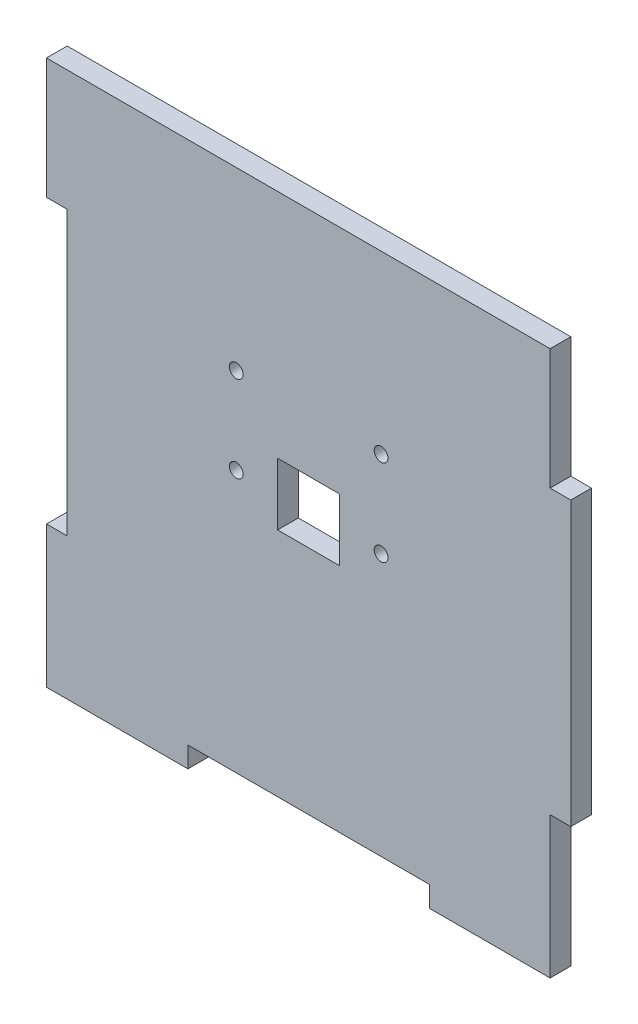
ISO-10303-21;
HEADER;
FILE_DESCRIPTION(('STEP AP214'),'2;1');
FILE_NAME('part.step','',(''),(''),'','','');
FILE_SCHEMA(('AUTOMOTIVE_DESIGN { 1 0 10303 214 1 1 1 1 }'));
ENDSEC;
DATA;
#1=APPLICATION_CONTEXT('core data for automotive mechanical design processes');
#2=APPLICATION_PROTOCOL_DEFINITION('international standard','automotive_design',2000,#1);
#3=PRODUCT_CONTEXT('',#1,'mechanical');
#4=PRODUCT('Part','Part','',(#3));
#5=PRODUCT_RELATED_PRODUCT_CATEGORY('part','',(#4));
#6=PRODUCT_DEFINITION_FORMATION('','',#4);
#7=PRODUCT_DEFINITION_CONTEXT('part definition',#1,'design');
#8=PRODUCT_DEFINITION('design','',#6,#7);
#9=PRODUCT_DEFINITION_SHAPE('','',#8);
#10=(LENGTH_UNIT() NAMED_UNIT(*) SI_UNIT(.MILLI.,.METRE.));
#11=(NAMED_UNIT(*) PLANE_ANGLE_UNIT() SI_UNIT($,.RADIAN.));
#12=(NAMED_UNIT(*) SI_UNIT($,.STERADIAN.) SOLID_ANGLE_UNIT());
#13=UNCERTAINTY_MEASURE_WITH_UNIT(LENGTH_MEASURE(1.E-05),#10,'distance_accuracy_value','');
#14=(GEOMETRIC_REPRESENTATION_CONTEXT(3) GLOBAL_UNCERTAINTY_ASSIGNED_CONTEXT((#13)) GLOBAL_UNIT_ASSIGNED_CONTEXT((#10,
#11,#12)) REPRESENTATION_CONTEXT('',''));
#15=CARTESIAN_POINT('',(0.,0.,0.));
#16=DIRECTION('',(0.,0.,1.));
#17=DIRECTION('',(1.,0.,0.));
#18=AXIS2_PLACEMENT_3D('',#15,#16,#17);
#19=CARTESIAN_POINT('',(35.,-20.5,3.));
#20=DIRECTION('',(0.,1.,0.));
#21=DIRECTION('',(-1.,0.,0.));
#22=AXIS2_PLACEMENT_3D('',#19,#20,#21);
#23=PLANE('',#22);
#24=DIRECTION('',(1.,0.,0.));
#25=VECTOR('',#24,1.);
#26=CARTESIAN_POINT('',(35.,-20.5,0.));
#27=LINE('',#26,#25);
#28=CARTESIAN_POINT('',(35.,-20.5,0.));
#29=VERTEX_POINT('',#28);
#30=CARTESIAN_POINT('',(38.,-20.5,0.));
#31=VERTEX_POINT('',#30);
#32=EDGE_CURVE('E246',#29,#31,#27,.T.);
#33=ORIENTED_EDGE('',*,*,#32,.T.);
#34=DIRECTION('',(0.,0.,-1.));
#35=VECTOR('',#34,1.);
#36=CARTESIAN_POINT('',(38.,-20.5,3.));
#37=LINE('',#36,#35);
#38=CARTESIAN_POINT('',(38.,-20.5,3.));
#39=VERTEX_POINT('',#38);
#40=EDGE_CURVE('E46',#39,#31,#37,.T.);
#41=ORIENTED_EDGE('',*,*,#40,.F.);
#42=DIRECTION('',(1.,0.,0.));
#43=VECTOR('',#42,1.);
#44=CARTESIAN_POINT('',(35.,-20.5,3.));
#45=LINE('',#44,#43);
#46=CARTESIAN_POINT('',(35.,-20.5,3.));
#47=VERTEX_POINT('',#46);
#48=EDGE_CURVE('E256',#47,#39,#45,.T.);
#49=ORIENTED_EDGE('',*,*,#48,.F.);
#50=DIRECTION('',(0.,0.,-1.));
#51=VECTOR('',#50,1.);
#52=CARTESIAN_POINT('',(35.,-20.5,3.));
#53=LINE('',#52,#51);
#54=EDGE_CURVE('E11',#47,#29,#53,.T.);
#55=ORIENTED_EDGE('',*,*,#54,.T.);
#56=EDGE_LOOP('',(#33,#41,#49,#55));
#57=FACE_BOUND('',#56,.T.);
#58=ADVANCED_FACE('F38',(#57),#23,.F.);
#59=CARTESIAN_POINT('',(38.,20.5,3.));
#60=DIRECTION('',(-1.,0.,0.));
#61=DIRECTION('',(0.,0.,1.));
#62=AXIS2_PLACEMENT_3D('',#59,#60,#61);
#63=PLANE('',#62);
#64=DIRECTION('',(0.,1.,0.));
#65=VECTOR('',#64,1.);
#66=CARTESIAN_POINT('',(38.,20.5,0.));
#67=LINE('',#66,#65);
#68=CARTESIAN_POINT('',(38.,20.5,0.));
#69=VERTEX_POINT('',#68);
#70=EDGE_CURVE('E306',#31,#69,#67,.T.);
#71=ORIENTED_EDGE('',*,*,#70,.T.);
#72=DIRECTION('',(0.,0.,-1.));
#73=VECTOR('',#72,1.);
#74=CARTESIAN_POINT('',(38.,20.5,3.));
#75=LINE('',#74,#73);
#76=CARTESIAN_POINT('',(38.,20.5,3.));
#77=VERTEX_POINT('',#76);
#78=EDGE_CURVE('E404',#77,#69,#75,.T.);
#79=ORIENTED_EDGE('',*,*,#78,.F.);
#80=DIRECTION('',(0.,1.,0.));
#81=VECTOR('',#80,1.);
#82=CARTESIAN_POINT('',(38.,20.5,3.));
#83=LINE('',#82,#81);
#84=EDGE_CURVE('E260',#39,#77,#83,.T.);
#85=ORIENTED_EDGE('',*,*,#84,.F.);
#86=ORIENTED_EDGE('',*,*,#40,.T.);
#87=EDGE_LOOP('',(#71,#79,#85,#86));
#88=FACE_BOUND('',#87,.T.);
#89=ADVANCED_FACE('F413',(#88),#63,.F.);
#90=CARTESIAN_POINT('',(35.,20.5,3.));
#91=DIRECTION('',(0.,-1.,0.));
#92=DIRECTION('',(1.,0.,0.));
#93=AXIS2_PLACEMENT_3D('',#90,#91,#92);
#94=PLANE('',#93);
#95=DIRECTION('',(-1.,0.,0.));
#96=VECTOR('',#95,1.);
#97=CARTESIAN_POINT('',(35.,20.5,0.));
#98=LINE('',#97,#96);
#99=CARTESIAN_POINT('',(35.,20.5,0.));
#100=VERTEX_POINT('',#99);
#101=EDGE_CURVE('E309',#69,#100,#98,.T.);
#102=ORIENTED_EDGE('',*,*,#101,.T.);
#103=DIRECTION('',(0.,0.,-1.));
#104=VECTOR('',#103,1.);
#105=CARTESIAN_POINT('',(35.,20.5,3.));
#106=LINE('',#105,#104);
#107=CARTESIAN_POINT('',(35.,20.5,3.));
#108=VERTEX_POINT('',#107);
#109=EDGE_CURVE('E400',#108,#100,#106,.T.);
#110=ORIENTED_EDGE('',*,*,#109,.F.);
#111=DIRECTION('',(-1.,0.,0.));
#112=VECTOR('',#111,1.);
#113=CARTESIAN_POINT('',(35.,20.5,3.));
#114=LINE('',#113,#112);
#115=EDGE_CURVE('E263',#77,#108,#114,.T.);
#116=ORIENTED_EDGE('',*,*,#115,.F.);
#117=ORIENTED_EDGE('',*,*,#78,.T.);
#118=EDGE_LOOP('',(#102,#110,#116,#117));
#119=FACE_BOUND('',#118,.T.);
#120=ADVANCED_FACE('F423',(#119),#94,.F.);
#121=CARTESIAN_POINT('',(35.,38.,3.));
#122=DIRECTION('',(-1.,0.,0.));
#123=DIRECTION('',(0.,-1.,0.));
#124=AXIS2_PLACEMENT_3D('',#121,#122,#123);
#125=PLANE('',#124);
#126=DIRECTION('',(0.,1.,0.));
#127=VECTOR('',#126,1.);
#128=CARTESIAN_POINT('',(35.,38.,0.));
#129=LINE('',#128,#127);
#130=CARTESIAN_POINT('',(35.,38.,0.));
#131=VERTEX_POINT('',#130);
#132=EDGE_CURVE('E312',#100,#131,#129,.T.);
#133=ORIENTED_EDGE('',*,*,#132,.T.);
#134=DIRECTION('',(0.,0.,-1.));
#135=VECTOR('',#134,1.);
#136=CARTESIAN_POINT('',(35.,38.,3.));
#137=LINE('',#136,#135);
#138=CARTESIAN_POINT('',(35.,38.,3.));
#139=VERTEX_POINT('',#138);
#140=EDGE_CURVE('E396',#139,#131,#137,.T.);
#141=ORIENTED_EDGE('',*,*,#140,.F.);
#142=DIRECTION('',(0.,1.,0.));
#143=VECTOR('',#142,1.);
#144=CARTESIAN_POINT('',(35.,38.,3.));
#145=LINE('',#144,#143);
#146=EDGE_CURVE('E266',#108,#139,#145,.T.);
#147=ORIENTED_EDGE('',*,*,#146,.F.);
#148=ORIENTED_EDGE('',*,*,#109,.T.);
#149=EDGE_LOOP('',(#133,#141,#147,#148));
#150=FACE_BOUND('',#149,.T.);
#151=ADVANCED_FACE('F427',(#150),#125,.F.);
#152=CARTESIAN_POINT('',(-38.,38.,3.));
#153=DIRECTION('',(0.,-1.,0.));
#154=DIRECTION('',(0.,0.,-1.));
#155=AXIS2_PLACEMENT_3D('',#152,#153,#154);
#156=PLANE('',#155);
#157=DIRECTION('',(-1.,0.,0.));
#158=VECTOR('',#157,1.);
#159=CARTESIAN_POINT('',(-38.,38.,0.));
#160=LINE('',#159,#158);
#161=CARTESIAN_POINT('',(-38.,38.,0.));
#162=VERTEX_POINT('',#161);
#163=EDGE_CURVE('E316',#131,#162,#160,.T.);
#164=ORIENTED_EDGE('',*,*,#163,.T.);
#165=DIRECTION('',(0.,0.,-1.));
#166=VECTOR('',#165,1.);
#167=CARTESIAN_POINT('',(-38.,38.,3.));
#168=LINE('',#167,#166);
#169=CARTESIAN_POINT('',(-38.,38.,3.));
#170=VERTEX_POINT('',#169);
#171=EDGE_CURVE('E392',#170,#162,#168,.T.);
#172=ORIENTED_EDGE('',*,*,#171,.F.);
#173=DIRECTION('',(-1.,0.,0.));
#174=VECTOR('',#173,1.);
#175=CARTESIAN_POINT('',(17.5,38.,3.));
#176=LINE('',#175,#174);
#177=EDGE_CURVE('E269',#139,#170,#176,.T.);
#178=ORIENTED_EDGE('',*,*,#177,.F.);
#179=ORIENTED_EDGE('',*,*,#140,.T.);
#180=EDGE_LOOP('',(#164,#172,#178,#179));
#181=FACE_BOUND('',#180,.T.);
#182=ADVANCED_FACE('F485',(#181),#156,.F.);
#183=CARTESIAN_POINT('',(-38.,20.5,3.));
#184=DIRECTION('',(1.,0.,0.));
#185=DIRECTION('',(0.,0.,-1.));
#186=AXIS2_PLACEMENT_3D('',#183,#184,#185);
#187=PLANE('',#186);
#188=DIRECTION('',(0.,-1.,0.));
#189=VECTOR('',#188,1.);
#190=CARTESIAN_POINT('',(-38.,20.5,0.));
#191=LINE('',#190,#189);
#192=CARTESIAN_POINT('',(-38.,20.5,0.));
#193=VERTEX_POINT('',#192);
#194=EDGE_CURVE('E319',#162,#193,#191,.T.);
#195=ORIENTED_EDGE('',*,*,#194,.T.);
#196=DIRECTION('',(0.,0.,-1.));
#197=VECTOR('',#196,1.);
#198=CARTESIAN_POINT('',(-38.,20.5,3.));
#199=LINE('',#198,#197);
#200=CARTESIAN_POINT('',(-38.,20.5,3.));
#201=VERTEX_POINT('',#200);
#202=EDGE_CURVE('E388',#201,#193,#199,.T.);
#203=ORIENTED_EDGE('',*,*,#202,.F.);
#204=DIRECTION('',(0.,-1.,0.));
#205=VECTOR('',#204,1.);
#206=CARTESIAN_POINT('',(-38.,20.5,3.));
#207=LINE('',#206,#205);
#208=EDGE_CURVE('E272',#170,#201,#207,.T.);
#209=ORIENTED_EDGE('',*,*,#208,.F.);
#210=ORIENTED_EDGE('',*,*,#171,.T.);
#211=EDGE_LOOP('',(#195,#203,#209,#210));
#212=FACE_BOUND('',#211,.T.);
#213=ADVANCED_FACE('F483',(#212),#187,.F.);
#214=CARTESIAN_POINT('',(-35.,20.5,3.));
#215=DIRECTION('',(0.,1.,0.));
#216=DIRECTION('',(0.,0.,1.));
#217=AXIS2_PLACEMENT_3D('',#214,#215,#216);
#218=PLANE('',#217);
#219=DIRECTION('',(1.,0.,0.));
#220=VECTOR('',#219,1.);
#221=CARTESIAN_POINT('',(-35.,20.5,0.));
#222=LINE('',#221,#220);
#223=CARTESIAN_POINT('',(-35.,20.5,0.));
#224=VERTEX_POINT('',#223);
#225=EDGE_CURVE('E322',#193,#224,#222,.T.);
#226=ORIENTED_EDGE('',*,*,#225,.T.);
#227=DIRECTION('',(0.,0.,-1.));
#228=VECTOR('',#227,1.);
#229=CARTESIAN_POINT('',(-35.,20.5,3.));
#230=LINE('',#229,#228);
#231=CARTESIAN_POINT('',(-35.,20.5,3.));
#232=VERTEX_POINT('',#231);
#233=EDGE_CURVE('E384',#232,#224,#230,.T.);
#234=ORIENTED_EDGE('',*,*,#233,.F.);
#235=DIRECTION('',(1.,0.,0.));
#236=VECTOR('',#235,1.);
#237=CARTESIAN_POINT('',(-35.,20.5,3.));
#238=LINE('',#237,#236);
#239=EDGE_CURVE('E275',#201,#232,#238,.T.);
#240=ORIENTED_EDGE('',*,*,#239,.F.);
#241=ORIENTED_EDGE('',*,*,#202,.T.);
#242=EDGE_LOOP('',(#226,#234,#240,#241));
#243=FACE_BOUND('',#242,.T.);
#244=ADVANCED_FACE('F478',(#243),#218,.F.);
#245=CARTESIAN_POINT('',(-35.,20.5,3.));
#246=DIRECTION('',(1.,0.,0.));
#247=DIRECTION('',(0.,0.,-1.));
#248=AXIS2_PLACEMENT_3D('',#245,#246,#247);
#249=PLANE('',#248);
#250=DIRECTION('',(0.,-1.,0.));
#251=VECTOR('',#250,1.);
#252=CARTESIAN_POINT('',(-35.,20.5,0.));
#253=LINE('',#252,#251);
#254=CARTESIAN_POINT('',(-35.,-20.5,0.));
#255=VERTEX_POINT('',#254);
#256=EDGE_CURVE('E325',#224,#255,#253,.T.);
#257=ORIENTED_EDGE('',*,*,#256,.T.);
#258=DIRECTION('',(0.,0.,-1.));
#259=VECTOR('',#258,1.);
#260=CARTESIAN_POINT('',(-35.,-20.5,3.));
#261=LINE('',#260,#259);
#262=CARTESIAN_POINT('',(-35.,-20.5,3.));
#263=VERTEX_POINT('',#262);
#264=EDGE_CURVE('E380',#263,#255,#261,.T.);
#265=ORIENTED_EDGE('',*,*,#264,.F.);
#266=DIRECTION('',(0.,-1.,0.));
#267=VECTOR('',#266,1.);
#268=CARTESIAN_POINT('',(-35.,20.5,3.));
#269=LINE('',#268,#267);
#270=EDGE_CURVE('E278',#232,#263,#269,.T.);
#271=ORIENTED_EDGE('',*,*,#270,.F.);
#272=ORIENTED_EDGE('',*,*,#233,.T.);
#273=EDGE_LOOP('',(#257,#265,#271,#272));
#274=FACE_BOUND('',#273,.T.);
#275=ADVANCED_FACE('F473',(#274),#249,.F.);
#276=CARTESIAN_POINT('',(-35.,-20.5,3.));
#277=DIRECTION('',(0.,-1.,0.));
#278=DIRECTION('',(0.,0.,-1.));
#279=AXIS2_PLACEMENT_3D('',#276,#277,#278);
#280=PLANE('',#279);
#281=DIRECTION('',(-1.,0.,0.));
#282=VECTOR('',#281,1.);
#283=CARTESIAN_POINT('',(-35.,-20.5,0.));
#284=LINE('',#283,#282);
#285=CARTESIAN_POINT('',(-38.,-20.5,0.));
#286=VERTEX_POINT('',#285);
#287=EDGE_CURVE('E328',#255,#286,#284,.T.);
#288=ORIENTED_EDGE('',*,*,#287,.T.);
#289=DIRECTION('',(0.,0.,-1.));
#290=VECTOR('',#289,1.);
#291=CARTESIAN_POINT('',(-38.,-20.5,3.));
#292=LINE('',#291,#290);
#293=CARTESIAN_POINT('',(-38.,-20.5,3.));
#294=VERTEX_POINT('',#293);
#295=EDGE_CURVE('E376',#294,#286,#292,.T.);
#296=ORIENTED_EDGE('',*,*,#295,.F.);
#297=DIRECTION('',(-1.,0.,0.));
#298=VECTOR('',#297,1.);
#299=CARTESIAN_POINT('',(-35.,-20.5,3.));
#300=LINE('',#299,#298);
#301=EDGE_CURVE('E281',#263,#294,#300,.T.);
#302=ORIENTED_EDGE('',*,*,#301,.F.);
#303=ORIENTED_EDGE('',*,*,#264,.T.);
#304=EDGE_LOOP('',(#288,#296,#302,#303));
#305=FACE_BOUND('',#304,.T.);
#306=ADVANCED_FACE('F468',(#305),#280,.F.);
#307=CARTESIAN_POINT('',(-38.,-38.,3.));
#308=DIRECTION('',(1.,0.,0.));
#309=DIRECTION('',(0.,0.,-1.));
#310=AXIS2_PLACEMENT_3D('',#307,#308,#309);
#311=PLANE('',#310);
#312=DIRECTION('',(0.,-1.,0.));
#313=VECTOR('',#312,1.);
#314=CARTESIAN_POINT('',(-38.,-38.,0.));
#315=LINE('',#314,#313);
#316=CARTESIAN_POINT('',(-38.,-41.,0.));
#317=VERTEX_POINT('',#316);
#318=EDGE_CURVE('E332',#286,#317,#315,.T.);
#319=ORIENTED_EDGE('',*,*,#318,.T.);
#320=DIRECTION('',(0.,0.,-1.));
#321=VECTOR('',#320,1.);
#322=CARTESIAN_POINT('',(-38.,-41.,3.));
#323=LINE('',#322,#321);
#324=CARTESIAN_POINT('',(-38.,-41.,3.));
#325=VERTEX_POINT('',#324);
#326=EDGE_CURVE('E372',#325,#317,#323,.T.);
#327=ORIENTED_EDGE('',*,*,#326,.F.);
#328=DIRECTION('',(0.,-1.,0.));
#329=VECTOR('',#328,1.);
#330=CARTESIAN_POINT('',(-38.,-20.5,3.));
#331=LINE('',#330,#329);
#332=EDGE_CURVE('E284',#294,#325,#331,.T.);
#333=ORIENTED_EDGE('',*,*,#332,.F.);
#334=ORIENTED_EDGE('',*,*,#295,.T.);
#335=EDGE_LOOP('',(#319,#327,#333,#334));
#336=FACE_BOUND('',#335,.T.);
#337=ADVANCED_FACE('F463',(#336),#311,.F.);
#338=CARTESIAN_POINT('',(-35.,-41.,3.));
#339=DIRECTION('',(0.,1.,0.));
#340=DIRECTION('',(0.,0.,1.));
#341=AXIS2_PLACEMENT_3D('',#338,#339,#340);
#342=PLANE('',#341);
#343=DIRECTION('',(1.,0.,0.));
#344=VECTOR('',#343,1.);
#345=CARTESIAN_POINT('',(-35.,-41.,0.));
#346=LINE('',#345,#344);
#347=CARTESIAN_POINT('',(-17.5,-41.,0.));
#348=VERTEX_POINT('',#347);
#349=EDGE_CURVE('E336',#317,#348,#346,.T.);
#350=ORIENTED_EDGE('',*,*,#349,.T.);
#351=DIRECTION('',(0.,0.,-1.));
#352=VECTOR('',#351,1.);
#353=CARTESIAN_POINT('',(-17.5,-41.,3.));
#354=LINE('',#353,#352);
#355=CARTESIAN_POINT('',(-17.5,-41.,3.));
#356=VERTEX_POINT('',#355);
#357=EDGE_CURVE('E368',#356,#348,#354,.T.);
#358=ORIENTED_EDGE('',*,*,#357,.F.);
#359=DIRECTION('',(1.,0.,0.));
#360=VECTOR('',#359,1.);
#361=CARTESIAN_POINT('',(-38.,-41.,3.));
#362=LINE('',#361,#360);
#363=EDGE_CURVE('E287',#325,#356,#362,.T.);
#364=ORIENTED_EDGE('',*,*,#363,.F.);
#365=ORIENTED_EDGE('',*,*,#326,.T.);
#366=EDGE_LOOP('',(#350,#358,#364,#365));
#367=FACE_BOUND('',#366,.T.);
#368=ADVANCED_FACE('F459',(#367),#342,.F.);
#369=CARTESIAN_POINT('',(-17.5,-38.,3.));
#370=DIRECTION('',(-1.,0.,0.));
#371=DIRECTION('',(0.,0.,1.));
#372=AXIS2_PLACEMENT_3D('',#369,#370,#371);
#373=PLANE('',#372);
#374=DIRECTION('',(0.,1.,0.));
#375=VECTOR('',#374,1.);
#376=CARTESIAN_POINT('',(-17.5,-38.,0.));
#377=LINE('',#376,#375);
#378=CARTESIAN_POINT('',(-17.5,-38.,0.));
#379=VERTEX_POINT('',#378);
#380=EDGE_CURVE('E339',#348,#379,#377,.T.);
#381=ORIENTED_EDGE('',*,*,#380,.T.);
#382=DIRECTION('',(0.,0.,-1.));
#383=VECTOR('',#382,1.);
#384=CARTESIAN_POINT('',(-17.5,-38.,3.));
#385=LINE('',#384,#383);
#386=CARTESIAN_POINT('',(-17.5,-38.,3.));
#387=VERTEX_POINT('',#386);
#388=EDGE_CURVE('E364',#387,#379,#385,.T.);
#389=ORIENTED_EDGE('',*,*,#388,.F.);
#390=DIRECTION('',(0.,1.,0.));
#391=VECTOR('',#390,1.);
#392=CARTESIAN_POINT('',(-17.5,-38.,3.));
#393=LINE('',#392,#391);
#394=EDGE_CURVE('E290',#356,#387,#393,.T.);
#395=ORIENTED_EDGE('',*,*,#394,.F.);
#396=ORIENTED_EDGE('',*,*,#357,.T.);
#397=EDGE_LOOP('',(#381,#389,#395,#396));
#398=FACE_BOUND('',#397,.T.);
#399=ADVANCED_FACE('F454',(#398),#373,.F.);
#400=CARTESIAN_POINT('',(-17.5,-38.,3.));
#401=DIRECTION('',(0.,1.,0.));
#402=DIRECTION('',(-1.,0.,0.));
#403=AXIS2_PLACEMENT_3D('',#400,#401,#402);
#404=PLANE('',#403);
#405=DIRECTION('',(1.,0.,0.));
#406=VECTOR('',#405,1.);
#407=CARTESIAN_POINT('',(-17.5,-38.,0.));
#408=LINE('',#407,#406);
#409=CARTESIAN_POINT('',(17.5,-38.,0.));
#410=VERTEX_POINT('',#409);
#411=EDGE_CURVE('E342',#379,#410,#408,.T.);
#412=ORIENTED_EDGE('',*,*,#411,.T.);
#413=DIRECTION('',(0.,0.,-1.));
#414=VECTOR('',#413,1.);
#415=CARTESIAN_POINT('',(17.5,-38.,3.));
#416=LINE('',#415,#414);
#417=CARTESIAN_POINT('',(17.5,-38.,3.));
#418=VERTEX_POINT('',#417);
#419=EDGE_CURVE('E360',#418,#410,#416,.T.);
#420=ORIENTED_EDGE('',*,*,#419,.F.);
#421=DIRECTION('',(1.,0.,0.));
#422=VECTOR('',#421,1.);
#423=CARTESIAN_POINT('',(-17.5,-38.,3.));
#424=LINE('',#423,#422);
#425=EDGE_CURVE('E293',#387,#418,#424,.T.);
#426=ORIENTED_EDGE('',*,*,#425,.F.);
#427=ORIENTED_EDGE('',*,*,#388,.T.);
#428=EDGE_LOOP('',(#412,#420,#426,#427));
#429=FACE_BOUND('',#428,.T.);
#430=ADVANCED_FACE('F450',(#429),#404,.F.);
#431=CARTESIAN_POINT('',(17.5,-41.,3.));
#432=DIRECTION('',(1.,0.,0.));
#433=DIRECTION('',(0.,1.,0.));
#434=AXIS2_PLACEMENT_3D('',#431,#432,#433);
#435=PLANE('',#434);
#436=DIRECTION('',(0.,-1.,0.));
#437=VECTOR('',#436,1.);
#438=CARTESIAN_POINT('',(17.5,-41.,0.));
#439=LINE('',#438,#437);
#440=CARTESIAN_POINT('',(17.5,-41.,0.));
#441=VERTEX_POINT('',#440);
#442=EDGE_CURVE('E345',#410,#441,#439,.T.);
#443=ORIENTED_EDGE('',*,*,#442,.T.);
#444=DIRECTION('',(0.,0.,-1.));
#445=VECTOR('',#444,1.);
#446=CARTESIAN_POINT('',(17.5,-41.,3.));
#447=LINE('',#446,#445);
#448=CARTESIAN_POINT('',(17.5,-41.,3.));
#449=VERTEX_POINT('',#448);
#450=EDGE_CURVE('E356',#449,#441,#447,.T.);
#451=ORIENTED_EDGE('',*,*,#450,.F.);
#452=DIRECTION('',(0.,-1.,0.));
#453=VECTOR('',#452,1.);
#454=CARTESIAN_POINT('',(17.5,-41.,3.));
#455=LINE('',#454,#453);
#456=EDGE_CURVE('E296',#418,#449,#455,.T.);
#457=ORIENTED_EDGE('',*,*,#456,.F.);
#458=ORIENTED_EDGE('',*,*,#419,.T.);
#459=EDGE_LOOP('',(#443,#451,#457,#458));
#460=FACE_BOUND('',#459,.T.);
#461=ADVANCED_FACE('F446',(#460),#435,.F.);
#462=CARTESIAN_POINT('',(35.,-41.,3.));
#463=DIRECTION('',(0.,1.,0.));
#464=DIRECTION('',(-1.,0.,0.));
#465=AXIS2_PLACEMENT_3D('',#462,#463,#464);
#466=PLANE('',#465);
#467=DIRECTION('',(1.,0.,0.));
#468=VECTOR('',#467,1.);
#469=CARTESIAN_POINT('',(35.,-41.,0.));
#470=LINE('',#469,#468);
#471=CARTESIAN_POINT('',(35.,-41.,0.));
#472=VERTEX_POINT('',#471);
#473=EDGE_CURVE('E348',#441,#472,#470,.T.);
#474=ORIENTED_EDGE('',*,*,#473,.T.);
#475=DIRECTION('',(0.,0.,-1.));
#476=VECTOR('',#475,1.);
#477=CARTESIAN_POINT('',(35.,-41.,3.));
#478=LINE('',#477,#476);
#479=CARTESIAN_POINT('',(35.,-41.,3.));
#480=VERTEX_POINT('',#479);
#481=EDGE_CURVE('E303',#480,#472,#478,.T.);
#482=ORIENTED_EDGE('',*,*,#481,.F.);
#483=DIRECTION('',(1.,0.,0.));
#484=VECTOR('',#483,1.);
#485=CARTESIAN_POINT('',(35.,-41.,3.));
#486=LINE('',#485,#484);
#487=EDGE_CURVE('E299',#449,#480,#486,.T.);
#488=ORIENTED_EDGE('',*,*,#487,.F.);
#489=ORIENTED_EDGE('',*,*,#450,.T.);
#490=EDGE_LOOP('',(#474,#482,#488,#489));
#491=FACE_BOUND('',#490,.T.);
#492=ADVANCED_FACE('F441',(#491),#466,.F.);
#493=CARTESIAN_POINT('',(35.,-38.,3.));
#494=DIRECTION('',(-1.,0.,0.));
#495=DIRECTION('',(0.,-1.,0.));
#496=AXIS2_PLACEMENT_3D('',#493,#494,#495);
#497=PLANE('',#496);
#498=DIRECTION('',(0.,1.,0.));
#499=VECTOR('',#498,1.);
#500=CARTESIAN_POINT('',(35.,-38.,0.));
#501=LINE('',#500,#499);
#502=EDGE_CURVE('E257',#472,#29,#501,.T.);
#503=ORIENTED_EDGE('',*,*,#502,.T.);
#504=ORIENTED_EDGE('',*,*,#54,.F.);
#505=DIRECTION('',(0.,1.,0.));
#506=VECTOR('',#505,1.);
#507=CARTESIAN_POINT('',(35.,-20.5,3.));
#508=LINE('',#507,#506);
#509=EDGE_CURVE('E252',#480,#47,#508,.T.);
#510=ORIENTED_EDGE('',*,*,#509,.F.);
#511=ORIENTED_EDGE('',*,*,#481,.T.);
#512=EDGE_LOOP('',(#503,#504,#510,#511));
#513=FACE_BOUND('',#512,.T.);
#514=ADVANCED_FACE('F435',(#513),#497,.F.);
#515=CARTESIAN_POINT('',(0.,0.,3.));
#516=DIRECTION('',(0.,0.,-1.));
#517=DIRECTION('',(-1.,0.,0.));
#518=AXIS2_PLACEMENT_3D('',#515,#516,#517);
#519=PLANE('',#518);
#520=CARTESIAN_POINT('',(10.5,0.,3.));
#521=DIRECTION('',(0.,0.,1.));
#522=DIRECTION('',(-1.,0.,0.));
#523=AXIS2_PLACEMENT_3D('',#520,#521,#522);
#524=CIRCLE('',#523,1.);
#525=CARTESIAN_POINT('',(9.5,0.,3.));
#526=VERTEX_POINT('',#525);
#527=EDGE_CURVE('E238',#526,#526,#524,.T.);
#528=ORIENTED_EDGE('',*,*,#527,.F.);
#529=EDGE_LOOP('',(#528));
#530=FACE_BOUND('',#529,.T.);
#531=CARTESIAN_POINT('',(10.5,12.5,3.));
#532=DIRECTION('',(0.,0.,1.));
#533=DIRECTION('',(-1.,0.,0.));
#534=AXIS2_PLACEMENT_3D('',#531,#532,#533);
#535=CIRCLE('',#534,1.);
#536=CARTESIAN_POINT('',(9.5,12.5,3.));
#537=VERTEX_POINT('',#536);
#538=EDGE_CURVE('E230',#537,#537,#535,.T.);
#539=ORIENTED_EDGE('',*,*,#538,.F.);
#540=EDGE_LOOP('',(#539));
#541=FACE_BOUND('',#540,.T.);
#542=DIRECTION('',(-1.,0.,0.));
#543=VECTOR('',#542,1.);
#544=CARTESIAN_POINT('',(-4.5,4.5,3.));
#545=LINE('',#544,#543);
#546=CARTESIAN_POINT('',(4.5,4.5,3.));
#547=VERTEX_POINT('',#546);
#548=CARTESIAN_POINT('',(-4.5,4.5,3.));
#549=VERTEX_POINT('',#548);
#550=EDGE_CURVE('E212',#547,#549,#545,.T.);
#551=ORIENTED_EDGE('',*,*,#550,.F.);
#552=DIRECTION('',(0.,1.,0.));
#553=VECTOR('',#552,1.);
#554=CARTESIAN_POINT('',(4.5,-4.5,3.));
#555=LINE('',#554,#553);
#556=CARTESIAN_POINT('',(4.5,-4.5,3.));
#557=VERTEX_POINT('',#556);
#558=EDGE_CURVE('E53',#557,#547,#555,.T.);
#559=ORIENTED_EDGE('',*,*,#558,.F.);
#560=DIRECTION('',(1.,0.,0.));
#561=VECTOR('',#560,1.);
#562=CARTESIAN_POINT('',(-4.5,-4.5,3.));
#563=LINE('',#562,#561);
#564=CARTESIAN_POINT('',(-4.5,-4.5,3.));
#565=VERTEX_POINT('',#564);
#566=EDGE_CURVE('E196',#565,#557,#563,.T.);
#567=ORIENTED_EDGE('',*,*,#566,.F.);
#568=DIRECTION('',(0.,-1.,0.));
#569=VECTOR('',#568,1.);
#570=CARTESIAN_POINT('',(-4.5,-4.5,3.));
#571=LINE('',#570,#569);
#572=EDGE_CURVE('E200',#549,#565,#571,.T.);
#573=ORIENTED_EDGE('',*,*,#572,.F.);
#574=EDGE_LOOP('',(#551,#559,#567,#573));
#575=FACE_BOUND('',#574,.T.);
#576=CARTESIAN_POINT('',(-10.5,0.,3.));
#577=DIRECTION('',(0.,0.,1.));
#578=DIRECTION('',(1.,0.,0.));
#579=AXIS2_PLACEMENT_3D('',#576,#577,#578);
#580=CIRCLE('',#579,1.);
#581=CARTESIAN_POINT('',(-9.5,0.,3.));
#582=VERTEX_POINT('',#581);
#583=EDGE_CURVE('E203',#582,#582,#580,.T.);
#584=ORIENTED_EDGE('',*,*,#583,.F.);
#585=EDGE_LOOP('',(#584));
#586=FACE_BOUND('',#585,.T.);
#587=CARTESIAN_POINT('',(-10.5,12.5,3.));
#588=DIRECTION('',(0.,0.,1.));
#589=DIRECTION('',(1.,0.,0.));
#590=AXIS2_PLACEMENT_3D('',#587,#588,#589);
#591=CIRCLE('',#590,1.);
#592=CARTESIAN_POINT('',(-9.5,12.5,3.));
#593=VERTEX_POINT('',#592);
#594=EDGE_CURVE('E247',#593,#593,#591,.T.);
#595=ORIENTED_EDGE('',*,*,#594,.F.);
#596=EDGE_LOOP('',(#595));
#597=FACE_BOUND('',#596,.T.);
#598=ORIENTED_EDGE('',*,*,#509,.T.);
#599=ORIENTED_EDGE('',*,*,#48,.T.);
#600=ORIENTED_EDGE('',*,*,#84,.T.);
#601=ORIENTED_EDGE('',*,*,#115,.T.);
#602=ORIENTED_EDGE('',*,*,#146,.T.);
#603=ORIENTED_EDGE('',*,*,#177,.T.);
#604=ORIENTED_EDGE('',*,*,#208,.T.);
#605=ORIENTED_EDGE('',*,*,#239,.T.);
#606=ORIENTED_EDGE('',*,*,#270,.T.);
#607=ORIENTED_EDGE('',*,*,#301,.T.);
#608=ORIENTED_EDGE('',*,*,#332,.T.);
#609=ORIENTED_EDGE('',*,*,#363,.T.);
#610=ORIENTED_EDGE('',*,*,#394,.T.);
#611=ORIENTED_EDGE('',*,*,#425,.T.);
#612=ORIENTED_EDGE('',*,*,#456,.T.);
#613=ORIENTED_EDGE('',*,*,#487,.T.);
#614=EDGE_LOOP('',(#598,#599,#600,#601,#602,#603,#604,#605,#606,#607,#608,#609,#610,#611,#612,#613));
#615=FACE_BOUND('',#614,.T.);
#616=ADVANCED_FACE('F431',(#530,#541,#575,#586,#597,#615),#519,.F.);
#617=CARTESIAN_POINT('',(0.,0.,0.));
#618=DIRECTION('',(0.,0.,-1.));
#619=DIRECTION('',(-1.,0.,0.));
#620=AXIS2_PLACEMENT_3D('',#617,#618,#619);
#621=PLANE('',#620);
#622=CARTESIAN_POINT('',(10.5,0.,0.));
#623=DIRECTION('',(0.,0.,1.));
#624=DIRECTION('',(-1.,0.,0.));
#625=AXIS2_PLACEMENT_3D('',#622,#623,#624);
#626=CIRCLE('',#625,1.);
#627=CARTESIAN_POINT('',(9.5,0.,0.));
#628=VERTEX_POINT('',#627);
#629=EDGE_CURVE('E234',#628,#628,#626,.T.);
#630=ORIENTED_EDGE('',*,*,#629,.T.);
#631=EDGE_LOOP('',(#630));
#632=FACE_BOUND('',#631,.T.);
#633=CARTESIAN_POINT('',(10.5,12.5,0.));
#634=DIRECTION('',(0.,0.,1.));
#635=DIRECTION('',(-1.,0.,0.));
#636=AXIS2_PLACEMENT_3D('',#633,#634,#635);
#637=CIRCLE('',#636,1.);
#638=CARTESIAN_POINT('',(9.5,12.5,0.));
#639=VERTEX_POINT('',#638);
#640=EDGE_CURVE('E213',#639,#639,#637,.T.);
#641=ORIENTED_EDGE('',*,*,#640,.T.);
#642=EDGE_LOOP('',(#641));
#643=FACE_BOUND('',#642,.T.);
#644=DIRECTION('',(0.,1.,0.));
#645=VECTOR('',#644,1.);
#646=CARTESIAN_POINT('',(4.5,-4.5,0.));
#647=LINE('',#646,#645);
#648=CARTESIAN_POINT('',(4.5,-4.5,0.));
#649=VERTEX_POINT('',#648);
#650=CARTESIAN_POINT('',(4.5,4.5,0.));
#651=VERTEX_POINT('',#650);
#652=EDGE_CURVE('E177',#649,#651,#647,.T.);
#653=ORIENTED_EDGE('',*,*,#652,.T.);
#654=DIRECTION('',(-1.,0.,0.));
#655=VECTOR('',#654,1.);
#656=CARTESIAN_POINT('',(-4.5,4.5,0.));
#657=LINE('',#656,#655);
#658=CARTESIAN_POINT('',(-4.5,4.5,0.));
#659=VERTEX_POINT('',#658);
#660=EDGE_CURVE('E187',#651,#659,#657,.T.);
#661=ORIENTED_EDGE('',*,*,#660,.T.);
#662=DIRECTION('',(0.,-1.,0.));
#663=VECTOR('',#662,1.);
#664=CARTESIAN_POINT('',(-4.5,-4.5,0.));
#665=LINE('',#664,#663);
#666=CARTESIAN_POINT('',(-4.5,-4.5,0.));
#667=VERTEX_POINT('',#666);
#668=EDGE_CURVE('E61',#659,#667,#665,.T.);
#669=ORIENTED_EDGE('',*,*,#668,.T.);
#670=DIRECTION('',(1.,0.,0.));
#671=VECTOR('',#670,1.);
#672=CARTESIAN_POINT('',(-4.5,-4.5,0.));
#673=LINE('',#672,#671);
#674=EDGE_CURVE('E184',#667,#649,#673,.T.);
#675=ORIENTED_EDGE('',*,*,#674,.T.);
#676=EDGE_LOOP('',(#653,#661,#669,#675));
#677=FACE_BOUND('',#676,.T.);
#678=CARTESIAN_POINT('',(-10.5,0.,0.));
#679=DIRECTION('',(0.,0.,1.));
#680=DIRECTION('',(1.,0.,0.));
#681=AXIS2_PLACEMENT_3D('',#678,#679,#680);
#682=CIRCLE('',#681,1.);
#683=CARTESIAN_POINT('',(-9.5,0.,0.));
#684=VERTEX_POINT('',#683);
#685=EDGE_CURVE('E251',#684,#684,#682,.T.);
#686=ORIENTED_EDGE('',*,*,#685,.T.);
#687=EDGE_LOOP('',(#686));
#688=FACE_BOUND('',#687,.T.);
#689=CARTESIAN_POINT('',(-10.5,12.5,0.));
#690=DIRECTION('',(0.,0.,1.));
#691=DIRECTION('',(1.,0.,0.));
#692=AXIS2_PLACEMENT_3D('',#689,#690,#691);
#693=CIRCLE('',#692,1.);
#694=CARTESIAN_POINT('',(-9.5,12.5,0.));
#695=VERTEX_POINT('',#694);
#696=EDGE_CURVE('E242',#695,#695,#693,.T.);
#697=ORIENTED_EDGE('',*,*,#696,.T.);
#698=EDGE_LOOP('',(#697));
#699=FACE_BOUND('',#698,.T.);
#700=ORIENTED_EDGE('',*,*,#32,.F.);
#701=ORIENTED_EDGE('',*,*,#502,.F.);
#702=ORIENTED_EDGE('',*,*,#473,.F.);
#703=ORIENTED_EDGE('',*,*,#442,.F.);
#704=ORIENTED_EDGE('',*,*,#411,.F.);
#705=ORIENTED_EDGE('',*,*,#380,.F.);
#706=ORIENTED_EDGE('',*,*,#349,.F.);
#707=ORIENTED_EDGE('',*,*,#318,.F.);
#708=ORIENTED_EDGE('',*,*,#287,.F.);
#709=ORIENTED_EDGE('',*,*,#256,.F.);
#710=ORIENTED_EDGE('',*,*,#225,.F.);
#711=ORIENTED_EDGE('',*,*,#194,.F.);
#712=ORIENTED_EDGE('',*,*,#163,.F.);
#713=ORIENTED_EDGE('',*,*,#132,.F.);
#714=ORIENTED_EDGE('',*,*,#101,.F.);
#715=ORIENTED_EDGE('',*,*,#70,.F.);
#716=EDGE_LOOP('',(#700,#701,#702,#703,#704,#705,#706,#707,#708,#709,#710,#711,#712,#713,#714,#715));
#717=FACE_BOUND('',#716,.T.);
#718=ADVANCED_FACE('F192',(#632,#643,#677,#688,#699,#717),#621,.T.);
#719=CARTESIAN_POINT('',(-10.5,12.5,0.));
#720=DIRECTION('',(0.,0.,1.));
#721=DIRECTION('',(1.,0.,0.));
#722=AXIS2_PLACEMENT_3D('',#719,#720,#721);
#723=CYLINDRICAL_SURFACE('',#722,1.);
#724=ORIENTED_EDGE('',*,*,#696,.F.);
#725=EDGE_LOOP('',(#724));
#726=FACE_BOUND('',#725,.T.);
#727=ORIENTED_EDGE('',*,*,#594,.T.);
#728=EDGE_LOOP('',(#727));
#729=FACE_BOUND('',#728,.T.);
#730=ADVANCED_FACE('F621',(#726,#729),#723,.F.);
#731=CARTESIAN_POINT('',(-10.5,0.,0.));
#732=DIRECTION('',(0.,0.,1.));
#733=DIRECTION('',(1.,0.,0.));
#734=AXIS2_PLACEMENT_3D('',#731,#732,#733);
#735=CYLINDRICAL_SURFACE('',#734,1.);
#736=ORIENTED_EDGE('',*,*,#685,.F.);
#737=EDGE_LOOP('',(#736));
#738=FACE_BOUND('',#737,.T.);
#739=ORIENTED_EDGE('',*,*,#583,.T.);
#740=EDGE_LOOP('',(#739));
#741=FACE_BOUND('',#740,.T.);
#742=ADVANCED_FACE('F631',(#738,#741),#735,.F.);
#743=CARTESIAN_POINT('',(4.5,-4.5,0.));
#744=DIRECTION('',(1.,0.,0.));
#745=DIRECTION('',(0.,0.,-1.));
#746=AXIS2_PLACEMENT_3D('',#743,#744,#745);
#747=PLANE('',#746);
#748=ORIENTED_EDGE('',*,*,#558,.T.);
#749=DIRECTION('',(0.,0.,1.));
#750=VECTOR('',#749,1.);
#751=CARTESIAN_POINT('',(4.5,4.5,0.));
#752=LINE('',#751,#750);
#753=EDGE_CURVE('E173',#651,#547,#752,.T.);
#754=ORIENTED_EDGE('',*,*,#753,.F.);
#755=ORIENTED_EDGE('',*,*,#652,.F.);
#756=DIRECTION('',(0.,0.,1.));
#757=VECTOR('',#756,1.);
#758=CARTESIAN_POINT('',(4.5,-4.5,0.));
#759=LINE('',#758,#757);
#760=EDGE_CURVE('E219',#649,#557,#759,.T.);
#761=ORIENTED_EDGE('',*,*,#760,.T.);
#762=EDGE_LOOP('',(#748,#754,#755,#761));
#763=FACE_BOUND('',#762,.T.);
#764=ADVANCED_FACE('F175',(#763),#747,.F.);
#765=CARTESIAN_POINT('',(-4.5,-4.5,0.));
#766=DIRECTION('',(0.,-1.,0.));
#767=DIRECTION('',(0.,0.,-1.));
#768=AXIS2_PLACEMENT_3D('',#765,#766,#767);
#769=PLANE('',#768);
#770=ORIENTED_EDGE('',*,*,#566,.T.);
#771=ORIENTED_EDGE('',*,*,#760,.F.);
#772=ORIENTED_EDGE('',*,*,#674,.F.);
#773=DIRECTION('',(0.,0.,1.));
#774=VECTOR('',#773,1.);
#775=CARTESIAN_POINT('',(-4.5,-4.5,0.));
#776=LINE('',#775,#774);
#777=EDGE_CURVE('E222',#667,#565,#776,.T.);
#778=ORIENTED_EDGE('',*,*,#777,.T.);
#779=EDGE_LOOP('',(#770,#771,#772,#778));
#780=FACE_BOUND('',#779,.T.);
#781=ADVANCED_FACE('F650',(#780),#769,.F.);
#782=CARTESIAN_POINT('',(-4.5,-4.5,0.));
#783=DIRECTION('',(-1.,0.,0.));
#784=DIRECTION('',(0.,0.,1.));
#785=AXIS2_PLACEMENT_3D('',#782,#783,#784);
#786=PLANE('',#785);
#787=ORIENTED_EDGE('',*,*,#572,.T.);
#788=ORIENTED_EDGE('',*,*,#777,.F.);
#789=ORIENTED_EDGE('',*,*,#668,.F.);
#790=DIRECTION('',(0.,0.,1.));
#791=VECTOR('',#790,1.);
#792=CARTESIAN_POINT('',(-4.5,4.5,0.));
#793=LINE('',#792,#791);
#794=EDGE_CURVE('E183',#659,#549,#793,.T.);
#795=ORIENTED_EDGE('',*,*,#794,.T.);
#796=EDGE_LOOP('',(#787,#788,#789,#795));
#797=FACE_BOUND('',#796,.T.);
#798=ADVANCED_FACE('F659',(#797),#786,.F.);
#799=CARTESIAN_POINT('',(-4.5,4.5,0.));
#800=DIRECTION('',(0.,1.,0.));
#801=DIRECTION('',(0.,0.,1.));
#802=AXIS2_PLACEMENT_3D('',#799,#800,#801);
#803=PLANE('',#802);
#804=ORIENTED_EDGE('',*,*,#550,.T.);
#805=ORIENTED_EDGE('',*,*,#794,.F.);
#806=ORIENTED_EDGE('',*,*,#660,.F.);
#807=ORIENTED_EDGE('',*,*,#753,.T.);
#808=EDGE_LOOP('',(#804,#805,#806,#807));
#809=FACE_BOUND('',#808,.T.);
#810=ADVANCED_FACE('F188',(#809),#803,.F.);
#811=CARTESIAN_POINT('',(10.5,12.5,0.));
#812=DIRECTION('',(0.,0.,1.));
#813=DIRECTION('',(1.,0.,0.));
#814=AXIS2_PLACEMENT_3D('',#811,#812,#813);
#815=CYLINDRICAL_SURFACE('',#814,1.);
#816=ORIENTED_EDGE('',*,*,#640,.F.);
#817=EDGE_LOOP('',(#816));
#818=FACE_BOUND('',#817,.T.);
#819=ORIENTED_EDGE('',*,*,#538,.T.);
#820=EDGE_LOOP('',(#819));
#821=FACE_BOUND('',#820,.T.);
#822=ADVANCED_FACE('F677',(#818,#821),#815,.F.);
#823=CARTESIAN_POINT('',(10.5,0.,0.));
#824=DIRECTION('',(0.,0.,1.));
#825=DIRECTION('',(1.,0.,0.));
#826=AXIS2_PLACEMENT_3D('',#823,#824,#825);
#827=CYLINDRICAL_SURFACE('',#826,1.);
#828=ORIENTED_EDGE('',*,*,#629,.F.);
#829=EDGE_LOOP('',(#828));
#830=FACE_BOUND('',#829,.T.);
#831=ORIENTED_EDGE('',*,*,#527,.T.);
#832=EDGE_LOOP('',(#831));
#833=FACE_BOUND('',#832,.T.);
#834=ADVANCED_FACE('F686',(#830,#833),#827,.F.);
#835=CLOSED_SHELL('',(#58,#89,#120,#151,#182,#213,#244,#275,#306,#337,#368,#399,#430,#461,#492,
#514,#616,#718,#730,#742,#764,#781,#798,#810,#822,#834));
#836=MANIFOLD_SOLID_BREP('B2',#835);
#837=ADVANCED_BREP_SHAPE_REPRESENTATION('',(#18,#836),#14);
#838=SHAPE_DEFINITION_REPRESENTATION(#9,#837);
ENDSEC;
END-ISO-10303-21;
